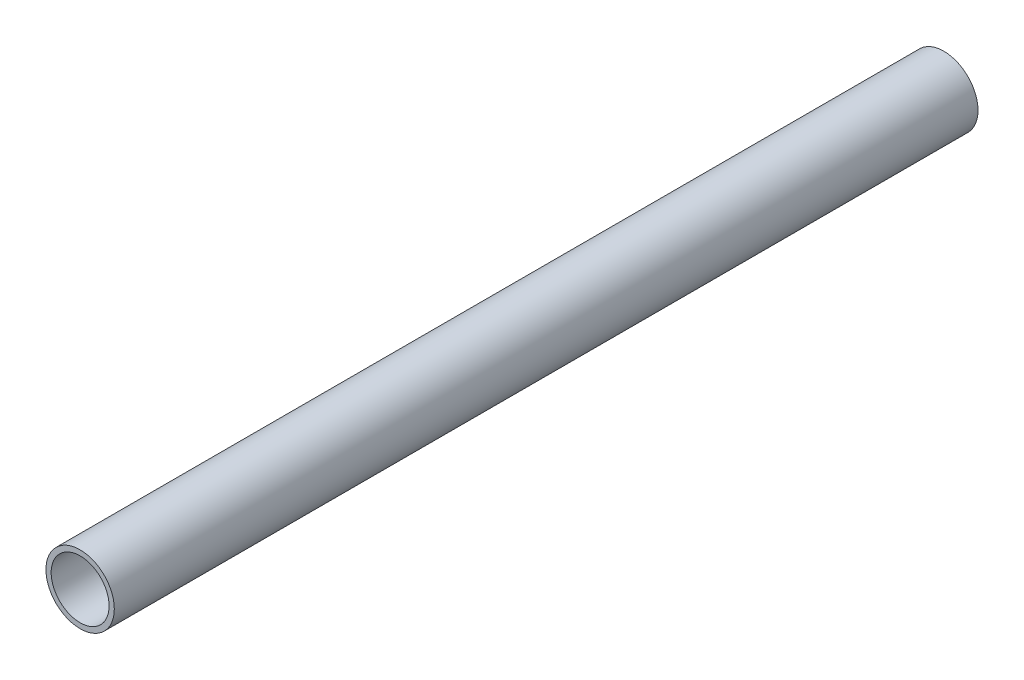
ISO-10303-21;
HEADER;
FILE_DESCRIPTION(('STEP AP214'),'2;1');
FILE_NAME('part.step','',(''),(''),'','','');
FILE_SCHEMA(('AUTOMOTIVE_DESIGN { 1 0 10303 214 1 1 1 1 }'));
ENDSEC;
DATA;
#1=APPLICATION_CONTEXT('core data for automotive mechanical design processes');
#2=APPLICATION_PROTOCOL_DEFINITION('international standard','automotive_design',2000,#1);
#3=PRODUCT_CONTEXT('',#1,'mechanical');
#4=PRODUCT('Part','Part','',(#3));
#5=PRODUCT_RELATED_PRODUCT_CATEGORY('part','',(#4));
#6=PRODUCT_DEFINITION_FORMATION('','',#4);
#7=PRODUCT_DEFINITION_CONTEXT('part definition',#1,'design');
#8=PRODUCT_DEFINITION('design','',#6,#7);
#9=PRODUCT_DEFINITION_SHAPE('','',#8);
#10=(LENGTH_UNIT() NAMED_UNIT(*) SI_UNIT(.MILLI.,.METRE.));
#11=(NAMED_UNIT(*) PLANE_ANGLE_UNIT() SI_UNIT($,.RADIAN.));
#12=(NAMED_UNIT(*) SI_UNIT($,.STERADIAN.) SOLID_ANGLE_UNIT());
#13=UNCERTAINTY_MEASURE_WITH_UNIT(LENGTH_MEASURE(1.E-05),#10,'distance_accuracy_value','');
#14=(GEOMETRIC_REPRESENTATION_CONTEXT(3) GLOBAL_UNCERTAINTY_ASSIGNED_CONTEXT((#13)) GLOBAL_UNIT_ASSIGNED_CONTEXT((#10,
#11,#12)) REPRESENTATION_CONTEXT('',''));
#15=CARTESIAN_POINT('',(0.,0.,0.));
#16=DIRECTION('',(0.,0.,1.));
#17=DIRECTION('',(1.,0.,0.));
#18=AXIS2_PLACEMENT_3D('',#15,#16,#17);
#19=CARTESIAN_POINT('',(0.,0.,304.8));
#20=DIRECTION('',(0.,0.,1.));
#21=DIRECTION('',(1.,0.,0.));
#22=AXIS2_PLACEMENT_3D('',#19,#20,#21);
#23=PLANE('',#22);
#24=CARTESIAN_POINT('',(0.,0.,304.8));
#25=DIRECTION('',(0.,0.,1.));
#26=DIRECTION('',(1.,0.,0.));
#27=AXIS2_PLACEMENT_3D('',#24,#25,#26);
#28=CIRCLE('',#27,24.1299999999999);
#29=CARTESIAN_POINT('',(24.1299999999999,0.,304.8));
#30=VERTEX_POINT('',#29);
#31=EDGE_CURVE('E13',#30,#30,#28,.T.);
#32=ORIENTED_EDGE('',*,*,#31,.T.);
#33=EDGE_LOOP('',(#32));
#34=FACE_BOUND('',#33,.T.);
#35=CARTESIAN_POINT('',(0.,0.,304.8));
#36=DIRECTION('',(0.,0.,1.));
#37=DIRECTION('',(1.,0.,0.));
#38=AXIS2_PLACEMENT_3D('',#35,#36,#37);
#39=CIRCLE('',#38,20.4469999999999);
#40=CARTESIAN_POINT('',(20.4469999999999,0.,304.8));
#41=VERTEX_POINT('',#40);
#42=EDGE_CURVE('E73',#41,#41,#39,.T.);
#43=ORIENTED_EDGE('',*,*,#42,.F.);
#44=EDGE_LOOP('',(#43));
#45=FACE_BOUND('',#44,.T.);
#46=ADVANCED_FACE('F59',(#34,#45),#23,.T.);
#47=CARTESIAN_POINT('',(0.,0.,-304.8));
#48=DIRECTION('',(0.,0.,1.));
#49=DIRECTION('',(1.,0.,0.));
#50=AXIS2_PLACEMENT_3D('',#47,#48,#49);
#51=PLANE('',#50);
#52=CARTESIAN_POINT('',(0.,0.,-304.8));
#53=DIRECTION('',(0.,0.,1.));
#54=DIRECTION('',(1.,0.,0.));
#55=AXIS2_PLACEMENT_3D('',#52,#53,#54);
#56=CIRCLE('',#55,24.1299999999999);
#57=CARTESIAN_POINT('',(24.1299999999999,0.,-304.8));
#58=VERTEX_POINT('',#57);
#59=EDGE_CURVE('E63',#58,#58,#56,.T.);
#60=ORIENTED_EDGE('',*,*,#59,.F.);
#61=EDGE_LOOP('',(#60));
#62=FACE_BOUND('',#61,.T.);
#63=CARTESIAN_POINT('',(0.,0.,-304.8));
#64=DIRECTION('',(0.,0.,1.));
#65=DIRECTION('',(1.,0.,0.));
#66=AXIS2_PLACEMENT_3D('',#63,#64,#65);
#67=CIRCLE('',#66,20.4469999999999);
#68=CARTESIAN_POINT('',(20.4469999999999,0.,-304.8));
#69=VERTEX_POINT('',#68);
#70=EDGE_CURVE('E75',#69,#69,#67,.T.);
#71=ORIENTED_EDGE('',*,*,#70,.T.);
#72=EDGE_LOOP('',(#71));
#73=FACE_BOUND('',#72,.T.);
#74=ADVANCED_FACE('F88',(#62,#73),#51,.F.);
#75=CARTESIAN_POINT('',(0.,0.,304.8));
#76=DIRECTION('',(0.,0.,-1.));
#77=DIRECTION('',(-1.,0.,0.));
#78=AXIS2_PLACEMENT_3D('',#75,#76,#77);
#79=CYLINDRICAL_SURFACE('',#78,24.1299999999999);
#80=ORIENTED_EDGE('',*,*,#31,.F.);
#81=EDGE_LOOP('',(#80));
#82=FACE_BOUND('',#81,.T.);
#83=ORIENTED_EDGE('',*,*,#59,.T.);
#84=EDGE_LOOP('',(#83));
#85=FACE_BOUND('',#84,.T.);
#86=ADVANCED_FACE('F61',(#82,#85),#79,.T.);
#87=CARTESIAN_POINT('',(0.,0.,304.8));
#88=DIRECTION('',(0.,0.,-1.));
#89=DIRECTION('',(-1.,0.,0.));
#90=AXIS2_PLACEMENT_3D('',#87,#88,#89);
#91=CYLINDRICAL_SURFACE('',#90,20.4469999999999);
#92=ORIENTED_EDGE('',*,*,#42,.T.);
#93=EDGE_LOOP('',(#92));
#94=FACE_BOUND('',#93,.T.);
#95=ORIENTED_EDGE('',*,*,#70,.F.);
#96=EDGE_LOOP('',(#95));
#97=FACE_BOUND('',#96,.T.);
#98=ADVANCED_FACE('F84',(#94,#97),#91,.F.);
#99=CLOSED_SHELL('',(#46,#74,#86,#98));
#100=MANIFOLD_SOLID_BREP('B2',#99);
#101=ADVANCED_BREP_SHAPE_REPRESENTATION('',(#18,#100),#14);
#102=SHAPE_DEFINITION_REPRESENTATION(#9,#101);
ENDSEC;
END-ISO-10303-21;
